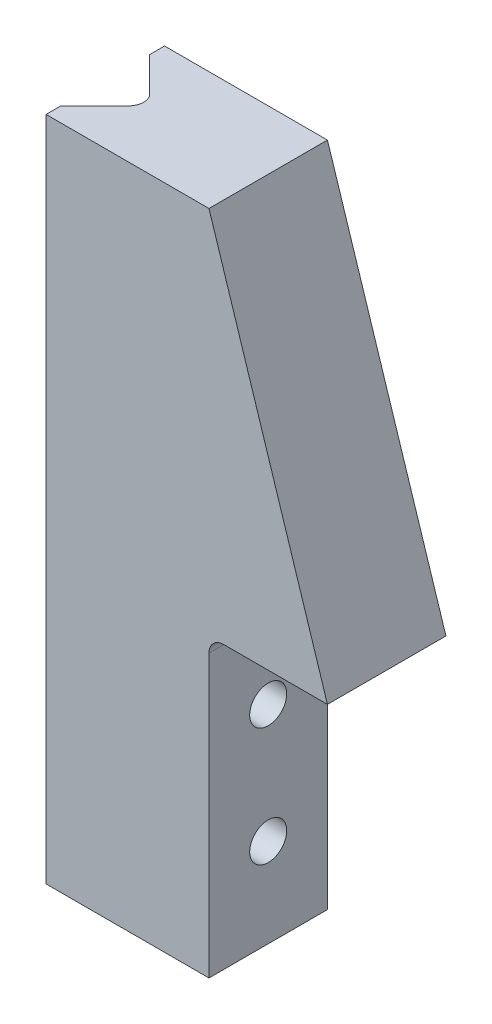
ISO-10303-21;
HEADER;
FILE_DESCRIPTION(('STEP AP214'),'2;1');
FILE_NAME('part.step','',(''),(''),'','','');
FILE_SCHEMA(('AUTOMOTIVE_DESIGN { 1 0 10303 214 1 1 1 1 }'));
ENDSEC;
DATA;
#1=APPLICATION_CONTEXT('core data for automotive mechanical design processes');
#2=APPLICATION_PROTOCOL_DEFINITION('international standard','automotive_design',2000,#1);
#3=PRODUCT_CONTEXT('',#1,'mechanical');
#4=PRODUCT('Part','Part','',(#3));
#5=PRODUCT_RELATED_PRODUCT_CATEGORY('part','',(#4));
#6=PRODUCT_DEFINITION_FORMATION('','',#4);
#7=PRODUCT_DEFINITION_CONTEXT('part definition',#1,'design');
#8=PRODUCT_DEFINITION('design','',#6,#7);
#9=PRODUCT_DEFINITION_SHAPE('','',#8);
#10=(LENGTH_UNIT() NAMED_UNIT(*) SI_UNIT(.MILLI.,.METRE.));
#11=(NAMED_UNIT(*) PLANE_ANGLE_UNIT() SI_UNIT($,.RADIAN.));
#12=(NAMED_UNIT(*) SI_UNIT($,.STERADIAN.) SOLID_ANGLE_UNIT());
#13=UNCERTAINTY_MEASURE_WITH_UNIT(LENGTH_MEASURE(1.E-05),#10,'distance_accuracy_value','');
#14=(GEOMETRIC_REPRESENTATION_CONTEXT(3) GLOBAL_UNCERTAINTY_ASSIGNED_CONTEXT((#13)) GLOBAL_UNIT_ASSIGNED_CONTEXT((#10,
#11,#12)) REPRESENTATION_CONTEXT('',''));
#15=CARTESIAN_POINT('',(0.,0.,0.));
#16=DIRECTION('',(0.,0.,1.));
#17=DIRECTION('',(1.,0.,0.));
#18=AXIS2_PLACEMENT_3D('',#15,#16,#17);
#19=CARTESIAN_POINT('',(-19.,-20.,8.));
#20=DIRECTION('',(1.,0.,0.));
#21=DIRECTION('',(0.,0.,-1.));
#22=AXIS2_PLACEMENT_3D('',#19,#20,#21);
#23=PLANE('',#22);
#24=DIRECTION('',(0.,0.,-1.));
#25=VECTOR('',#24,1.);
#26=CARTESIAN_POINT('',(-19.,-20.,8.));
#27=LINE('',#26,#25);
#28=CARTESIAN_POINT('',(-19.,-20.,1.));
#29=VERTEX_POINT('',#28);
#30=CARTESIAN_POINT('',(-19.,-20.,0.));
#31=VERTEX_POINT('',#30);
#32=EDGE_CURVE('E195',#29,#31,#27,.T.);
#33=ORIENTED_EDGE('',*,*,#32,.F.);
#34=DIRECTION('',(0.,1.,0.));
#35=VECTOR('',#34,1.);
#36=CARTESIAN_POINT('',(-19.,-20.,1.));
#37=LINE('',#36,#35);
#38=CARTESIAN_POINT('',(-19.,25.,1.));
#39=VERTEX_POINT('',#38);
#40=EDGE_CURVE('E157',#29,#39,#37,.T.);
#41=ORIENTED_EDGE('',*,*,#40,.T.);
#42=DIRECTION('',(0.,0.,-1.));
#43=VECTOR('',#42,1.);
#44=CARTESIAN_POINT('',(-19.,25.,8.));
#45=LINE('',#44,#43);
#46=CARTESIAN_POINT('',(-19.,25.,0.));
#47=VERTEX_POINT('',#46);
#48=EDGE_CURVE('E199',#39,#47,#45,.T.);
#49=ORIENTED_EDGE('',*,*,#48,.T.);
#50=DIRECTION('',(0.,-1.,0.));
#51=VECTOR('',#50,1.);
#52=CARTESIAN_POINT('',(-19.,-20.,0.));
#53=LINE('',#52,#51);
#54=EDGE_CURVE('E182',#47,#31,#53,.T.);
#55=ORIENTED_EDGE('',*,*,#54,.T.);
#56=EDGE_LOOP('',(#33,#41,#49,#55));
#57=FACE_BOUND('',#56,.T.);
#58=ADVANCED_FACE('F38',(#57),#23,.F.);
#59=CARTESIAN_POINT('',(-8.,25.,8.));
#60=DIRECTION('',(-0.952424147199324,-0.304775727103784,0.));
#61=DIRECTION('',(0.304775727103784,-0.952424147199324,0.));
#62=AXIS2_PLACEMENT_3D('',#59,#60,#61);
#63=PLANE('',#62);
#64=DIRECTION('',(-0.304775727103784,0.952424147199324,0.));
#65=VECTOR('',#64,1.);
#66=CARTESIAN_POINT('',(-8.,25.,0.));
#67=LINE('',#66,#65);
#68=CARTESIAN_POINT('',(0.,0.,0.));
#69=VERTEX_POINT('',#68);
#70=CARTESIAN_POINT('',(-8.,25.,0.));
#71=VERTEX_POINT('',#70);
#72=EDGE_CURVE('E160',#69,#71,#67,.T.);
#73=ORIENTED_EDGE('',*,*,#72,.T.);
#74=DIRECTION('',(0.,0.,-1.));
#75=VECTOR('',#74,1.);
#76=CARTESIAN_POINT('',(-8.,25.,8.));
#77=LINE('',#76,#75);
#78=CARTESIAN_POINT('',(-8.,25.,8.));
#79=VERTEX_POINT('',#78);
#80=EDGE_CURVE('E203',#79,#71,#77,.T.);
#81=ORIENTED_EDGE('',*,*,#80,.F.);
#82=DIRECTION('',(-0.304775727103784,0.952424147199324,0.));
#83=VECTOR('',#82,1.);
#84=CARTESIAN_POINT('',(-8.,25.,8.));
#85=LINE('',#84,#83);
#86=CARTESIAN_POINT('',(0.,0.,8.));
#87=VERTEX_POINT('',#86);
#88=EDGE_CURVE('E162',#87,#79,#85,.T.);
#89=ORIENTED_EDGE('',*,*,#88,.F.);
#90=DIRECTION('',(0.,0.,-1.));
#91=VECTOR('',#90,1.);
#92=CARTESIAN_POINT('',(0.,0.,8.));
#93=LINE('',#92,#91);
#94=EDGE_CURVE('E176',#87,#69,#93,.T.);
#95=ORIENTED_EDGE('',*,*,#94,.T.);
#96=EDGE_LOOP('',(#73,#81,#89,#95));
#97=FACE_BOUND('',#96,.T.);
#98=ADVANCED_FACE('F230',(#97),#63,.F.);
#99=CARTESIAN_POINT('',(-19.,25.,8.));
#100=DIRECTION('',(0.,-1.,0.));
#101=DIRECTION('',(0.,0.,-1.));
#102=AXIS2_PLACEMENT_3D('',#99,#100,#101);
#103=PLANE('',#102);
#104=ORIENTED_EDGE('',*,*,#48,.F.);
#105=DIRECTION('',(-0.707106781186554,0.,-0.707106781186541));
#106=VECTOR('',#105,1.);
#107=CARTESIAN_POINT('',(-19.,25.,1.));
#108=LINE('',#107,#106);
#109=CARTESIAN_POINT('',(-16.7071067811865,25.,3.29289321881346));
#110=VERTEX_POINT('',#109);
#111=EDGE_CURVE('E151',#110,#39,#108,.T.);
#112=ORIENTED_EDGE('',*,*,#111,.F.);
#113=CARTESIAN_POINT('',(-17.414213562373,25.,4.00000000000001));
#114=DIRECTION('',(0.,-1.,0.));
#115=DIRECTION('',(0.,0.,-1.));
#116=AXIS2_PLACEMENT_3D('',#113,#114,#115);
#117=CIRCLE('',#116,1.);
#118=CARTESIAN_POINT('',(-16.7071067811865,25.,4.70710678118655));
#119=VERTEX_POINT('',#118);
#120=EDGE_CURVE('E211',#110,#119,#117,.T.);
#121=ORIENTED_EDGE('',*,*,#120,.T.);
#122=DIRECTION('',(0.707106781186541,0.,-0.707106781186554));
#123=VECTOR('',#122,1.);
#124=CARTESIAN_POINT('',(-15.9999999999999,25.,4.));
#125=LINE('',#124,#123);
#126=CARTESIAN_POINT('',(-19.,25.,7.0000000000001));
#127=VERTEX_POINT('',#126);
#128=EDGE_CURVE('E146',#127,#119,#125,.T.);
#129=ORIENTED_EDGE('',*,*,#128,.F.);
#130=CARTESIAN_POINT('',(-19.,25.,8.));
#131=VERTEX_POINT('',#130);
#132=EDGE_CURVE('E200',#131,#127,#45,.T.);
#133=ORIENTED_EDGE('',*,*,#132,.F.);
#134=DIRECTION('',(-1.,0.,0.));
#135=VECTOR('',#134,1.);
#136=CARTESIAN_POINT('',(-19.,25.,8.));
#137=LINE('',#136,#135);
#138=EDGE_CURVE('E165',#79,#131,#137,.T.);
#139=ORIENTED_EDGE('',*,*,#138,.F.);
#140=ORIENTED_EDGE('',*,*,#80,.T.);
#141=DIRECTION('',(-1.,0.,0.));
#142=VECTOR('',#141,1.);
#143=CARTESIAN_POINT('',(-19.,25.,0.));
#144=LINE('',#143,#142);
#145=EDGE_CURVE('E179',#71,#47,#144,.T.);
#146=ORIENTED_EDGE('',*,*,#145,.T.);
#147=EDGE_LOOP('',(#104,#112,#121,#129,#133,#139,#140,#146));
#148=FACE_BOUND('',#147,.T.);
#149=ADVANCED_FACE('F248',(#148),#103,.F.);
#150=ORIENTED_EDGE('',*,*,#132,.T.);
#151=DIRECTION('',(0.,1.,0.));
#152=VECTOR('',#151,1.);
#153=CARTESIAN_POINT('',(-19.,-20.,7.0000000000001));
#154=LINE('',#153,#152);
#155=CARTESIAN_POINT('',(-19.,-20.,7.0000000000001));
#156=VERTEX_POINT('',#155);
#157=EDGE_CURVE('E153',#156,#127,#154,.T.);
#158=ORIENTED_EDGE('',*,*,#157,.F.);
#159=CARTESIAN_POINT('',(-19.,-20.,8.));
#160=VERTEX_POINT('',#159);
#161=EDGE_CURVE('E196',#160,#156,#27,.T.);
#162=ORIENTED_EDGE('',*,*,#161,.F.);
#163=DIRECTION('',(0.,-1.,0.));
#164=VECTOR('',#163,1.);
#165=CARTESIAN_POINT('',(-19.,-20.,8.));
#166=LINE('',#165,#164);
#167=EDGE_CURVE('E168',#131,#160,#166,.T.);
#168=ORIENTED_EDGE('',*,*,#167,.F.);
#169=EDGE_LOOP('',(#150,#158,#162,#168));
#170=FACE_BOUND('',#169,.T.);
#171=ADVANCED_FACE('F244',(#170),#23,.F.);
#172=CARTESIAN_POINT('',(-8.,-20.,8.));
#173=DIRECTION('',(0.,1.,0.));
#174=DIRECTION('',(-1.,0.,0.));
#175=AXIS2_PLACEMENT_3D('',#172,#173,#174);
#176=PLANE('',#175);
#177=DIRECTION('',(0.707106781186541,0.,-0.707106781186554));
#178=VECTOR('',#177,1.);
#179=CARTESIAN_POINT('',(-15.9999999999999,-20.,4.));
#180=LINE('',#179,#178);
#181=CARTESIAN_POINT('',(-16.7071067811865,-20.,4.70710678118655));
#182=VERTEX_POINT('',#181);
#183=EDGE_CURVE('E147',#156,#182,#180,.T.);
#184=ORIENTED_EDGE('',*,*,#183,.T.);
#185=CARTESIAN_POINT('',(-17.414213562373,-20.,4.00000000000001));
#186=DIRECTION('',(0.,1.,0.));
#187=DIRECTION('',(-1.,0.,0.));
#188=AXIS2_PLACEMENT_3D('',#185,#186,#187);
#189=CIRCLE('',#188,1.);
#190=CARTESIAN_POINT('',(-16.7071067811865,-20.,3.29289321881346));
#191=VERTEX_POINT('',#190);
#192=EDGE_CURVE('E213',#182,#191,#189,.T.);
#193=ORIENTED_EDGE('',*,*,#192,.T.);
#194=DIRECTION('',(-0.707106781186554,0.,-0.707106781186541));
#195=VECTOR('',#194,1.);
#196=CARTESIAN_POINT('',(-19.,-20.,1.));
#197=LINE('',#196,#195);
#198=EDGE_CURVE('E150',#191,#29,#197,.T.);
#199=ORIENTED_EDGE('',*,*,#198,.T.);
#200=ORIENTED_EDGE('',*,*,#32,.T.);
#201=DIRECTION('',(1.,0.,0.));
#202=VECTOR('',#201,1.);
#203=CARTESIAN_POINT('',(-8.,-20.,0.));
#204=LINE('',#203,#202);
#205=CARTESIAN_POINT('',(-8.,-20.,0.));
#206=VERTEX_POINT('',#205);
#207=EDGE_CURVE('E185',#31,#206,#204,.T.);
#208=ORIENTED_EDGE('',*,*,#207,.T.);
#209=DIRECTION('',(0.,0.,-1.));
#210=VECTOR('',#209,1.);
#211=CARTESIAN_POINT('',(-8.,-20.,8.));
#212=LINE('',#211,#210);
#213=CARTESIAN_POINT('',(-8.,-20.,8.));
#214=VERTEX_POINT('',#213);
#215=EDGE_CURVE('E192',#214,#206,#212,.T.);
#216=ORIENTED_EDGE('',*,*,#215,.F.);
#217=DIRECTION('',(1.,0.,0.));
#218=VECTOR('',#217,1.);
#219=CARTESIAN_POINT('',(-8.,-20.,8.));
#220=LINE('',#219,#218);
#221=EDGE_CURVE('E170',#160,#214,#220,.T.);
#222=ORIENTED_EDGE('',*,*,#221,.F.);
#223=ORIENTED_EDGE('',*,*,#161,.T.);
#224=EDGE_LOOP('',(#184,#193,#199,#200,#208,#216,#222,#223));
#225=FACE_BOUND('',#224,.T.);
#226=ADVANCED_FACE('F254',(#225),#176,.F.);
#227=CARTESIAN_POINT('',(-8.,0.,8.));
#228=DIRECTION('',(-1.,0.,0.));
#229=DIRECTION('',(0.,0.,1.));
#230=AXIS2_PLACEMENT_3D('',#227,#228,#229);
#231=PLANE('',#230);
#232=CARTESIAN_POINT('',(-8.,-6.,4.));
#233=DIRECTION('',(1.,0.,0.));
#234=DIRECTION('',(0.,0.,-1.));
#235=AXIS2_PLACEMENT_3D('',#232,#233,#234);
#236=CIRCLE('',#235,1.25);
#237=CARTESIAN_POINT('',(-8.,-6.,2.75));
#238=VERTEX_POINT('',#237);
#239=EDGE_CURVE('E136',#238,#238,#236,.T.);
#240=ORIENTED_EDGE('',*,*,#239,.F.);
#241=EDGE_LOOP('',(#240));
#242=FACE_BOUND('',#241,.T.);
#243=CARTESIAN_POINT('',(-8.,-14.,4.));
#244=DIRECTION('',(1.,0.,0.));
#245=DIRECTION('',(0.,0.,-1.));
#246=AXIS2_PLACEMENT_3D('',#243,#244,#245);
#247=CIRCLE('',#246,1.25);
#248=CARTESIAN_POINT('',(-8.,-14.,2.75));
#249=VERTEX_POINT('',#248);
#250=EDGE_CURVE('E135',#249,#249,#247,.T.);
#251=ORIENTED_EDGE('',*,*,#250,.F.);
#252=EDGE_LOOP('',(#251));
#253=FACE_BOUND('',#252,.T.);
#254=DIRECTION('',(0.,1.,0.));
#255=VECTOR('',#254,1.);
#256=CARTESIAN_POINT('',(-8.,0.,0.));
#257=LINE('',#256,#255);
#258=CARTESIAN_POINT('',(-8.,-1.,0.));
#259=VERTEX_POINT('',#258);
#260=EDGE_CURVE('E187',#206,#259,#257,.T.);
#261=ORIENTED_EDGE('',*,*,#260,.T.);
#262=DIRECTION('',(0.,0.,-1.));
#263=VECTOR('',#262,1.);
#264=CARTESIAN_POINT('',(-8.,-1.,8.));
#265=LINE('',#264,#263);
#266=CARTESIAN_POINT('',(-8.,-1.,8.));
#267=VERTEX_POINT('',#266);
#268=EDGE_CURVE('E53',#259,#267,#265,.F.);
#269=ORIENTED_EDGE('',*,*,#268,.T.);
#270=DIRECTION('',(0.,1.,0.));
#271=VECTOR('',#270,1.);
#272=CARTESIAN_POINT('',(-8.,0.,8.));
#273=LINE('',#272,#271);
#274=EDGE_CURVE('E172',#214,#267,#273,.T.);
#275=ORIENTED_EDGE('',*,*,#274,.F.);
#276=ORIENTED_EDGE('',*,*,#215,.T.);
#277=EDGE_LOOP('',(#261,#269,#275,#276));
#278=FACE_BOUND('',#277,.T.);
#279=ADVANCED_FACE('F261',(#242,#253,#278),#231,.F.);
#280=CARTESIAN_POINT('',(0.,0.,8.));
#281=DIRECTION('',(0.,1.,0.));
#282=DIRECTION('',(0.,0.,1.));
#283=AXIS2_PLACEMENT_3D('',#280,#281,#282);
#284=PLANE('',#283);
#285=DIRECTION('',(1.,0.,0.));
#286=VECTOR('',#285,1.);
#287=CARTESIAN_POINT('',(0.,0.,8.));
#288=LINE('',#287,#286);
#289=CARTESIAN_POINT('',(-7.,0.,8.));
#290=VERTEX_POINT('',#289);
#291=EDGE_CURVE('E174',#290,#87,#288,.T.);
#292=ORIENTED_EDGE('',*,*,#291,.F.);
#293=DIRECTION('',(0.,0.,-1.));
#294=VECTOR('',#293,1.);
#295=CARTESIAN_POINT('',(-7.,0.,0.));
#296=LINE('',#295,#294);
#297=CARTESIAN_POINT('',(-7.,0.,0.));
#298=VERTEX_POINT('',#297);
#299=EDGE_CURVE('E215',#290,#298,#296,.T.);
#300=ORIENTED_EDGE('',*,*,#299,.T.);
#301=DIRECTION('',(1.,0.,0.));
#302=VECTOR('',#301,1.);
#303=CARTESIAN_POINT('',(0.,0.,0.));
#304=LINE('',#303,#302);
#305=EDGE_CURVE('E166',#298,#69,#304,.T.);
#306=ORIENTED_EDGE('',*,*,#305,.T.);
#307=ORIENTED_EDGE('',*,*,#94,.F.);
#308=EDGE_LOOP('',(#292,#300,#306,#307));
#309=FACE_BOUND('',#308,.T.);
#310=ADVANCED_FACE('F221',(#309),#284,.F.);
#311=CARTESIAN_POINT('',(0.,0.,8.));
#312=DIRECTION('',(0.,0.,-1.));
#313=DIRECTION('',(-1.,0.,0.));
#314=AXIS2_PLACEMENT_3D('',#311,#312,#313);
#315=PLANE('',#314);
#316=ORIENTED_EDGE('',*,*,#88,.T.);
#317=ORIENTED_EDGE('',*,*,#138,.T.);
#318=ORIENTED_EDGE('',*,*,#167,.T.);
#319=ORIENTED_EDGE('',*,*,#221,.T.);
#320=ORIENTED_EDGE('',*,*,#274,.T.);
#321=CARTESIAN_POINT('',(-7.,-1.,8.));
#322=DIRECTION('',(0.,0.,-1.));
#323=DIRECTION('',(-1.,0.,0.));
#324=AXIS2_PLACEMENT_3D('',#321,#322,#323);
#325=CIRCLE('',#324,1.);
#326=EDGE_CURVE('E11',#267,#290,#325,.T.);
#327=ORIENTED_EDGE('',*,*,#326,.T.);
#328=ORIENTED_EDGE('',*,*,#291,.T.);
#329=EDGE_LOOP('',(#316,#317,#318,#319,#320,#327,#328));
#330=FACE_BOUND('',#329,.T.);
#331=ADVANCED_FACE('F233',(#330),#315,.F.);
#332=CARTESIAN_POINT('',(0.,0.,0.));
#333=DIRECTION('',(0.,0.,-1.));
#334=DIRECTION('',(-1.,0.,0.));
#335=AXIS2_PLACEMENT_3D('',#332,#333,#334);
#336=PLANE('',#335);
#337=ORIENTED_EDGE('',*,*,#72,.F.);
#338=ORIENTED_EDGE('',*,*,#305,.F.);
#339=CARTESIAN_POINT('',(-7.,-1.,0.));
#340=DIRECTION('',(0.,0.,-1.));
#341=DIRECTION('',(-1.,0.,0.));
#342=AXIS2_PLACEMENT_3D('',#339,#340,#341);
#343=CIRCLE('',#342,1.);
#344=EDGE_CURVE('E46',#298,#259,#343,.F.);
#345=ORIENTED_EDGE('',*,*,#344,.T.);
#346=ORIENTED_EDGE('',*,*,#260,.F.);
#347=ORIENTED_EDGE('',*,*,#207,.F.);
#348=ORIENTED_EDGE('',*,*,#54,.F.);
#349=ORIENTED_EDGE('',*,*,#145,.F.);
#350=EDGE_LOOP('',(#337,#338,#345,#346,#347,#348,#349));
#351=FACE_BOUND('',#350,.T.);
#352=ADVANCED_FACE('F226',(#351),#336,.T.);
#353=CARTESIAN_POINT('',(-19.,-20.,1.));
#354=DIRECTION('',(0.707106781186541,0.,-0.707106781186553));
#355=DIRECTION('',(-0.707106781186554,0.,-0.707106781186542));
#356=AXIS2_PLACEMENT_3D('',#353,#354,#355);
#357=PLANE('',#356);
#358=ORIENTED_EDGE('',*,*,#198,.F.);
#359=DIRECTION('',(0.,1.,0.));
#360=VECTOR('',#359,1.);
#361=CARTESIAN_POINT('',(-16.7071067811865,25.,3.29289321881346));
#362=LINE('',#361,#360);
#363=EDGE_CURVE('E206',#191,#110,#362,.T.);
#364=ORIENTED_EDGE('',*,*,#363,.T.);
#365=ORIENTED_EDGE('',*,*,#111,.T.);
#366=ORIENTED_EDGE('',*,*,#40,.F.);
#367=EDGE_LOOP('',(#358,#364,#365,#366));
#368=FACE_BOUND('',#367,.T.);
#369=ADVANCED_FACE('F279',(#368),#357,.F.);
#370=CARTESIAN_POINT('',(-15.9999999999999,-20.,4.));
#371=DIRECTION('',(0.707106781186554,0.,0.707106781186541));
#372=DIRECTION('',(0.707106781186541,0.,-0.707106781186554));
#373=AXIS2_PLACEMENT_3D('',#370,#371,#372);
#374=PLANE('',#373);
#375=ORIENTED_EDGE('',*,*,#128,.T.);
#376=DIRECTION('',(0.,1.,0.));
#377=VECTOR('',#376,1.);
#378=CARTESIAN_POINT('',(-16.7071067811865,-20.,4.70710678118655));
#379=LINE('',#378,#377);
#380=EDGE_CURVE('E209',#119,#182,#379,.F.);
#381=ORIENTED_EDGE('',*,*,#380,.T.);
#382=ORIENTED_EDGE('',*,*,#183,.F.);
#383=ORIENTED_EDGE('',*,*,#157,.T.);
#384=EDGE_LOOP('',(#375,#381,#382,#383));
#385=FACE_BOUND('',#384,.T.);
#386=ADVANCED_FACE('F273',(#385),#374,.F.);
#387=CARTESIAN_POINT('',(-13.,-14.,4.));
#388=DIRECTION('',(1.,0.,0.));
#389=DIRECTION('',(0.,0.,-1.));
#390=AXIS2_PLACEMENT_3D('',#387,#388,#389);
#391=CONICAL_SURFACE('',#390,1.25,1.02974425867665);
#392=CARTESIAN_POINT('',(-13.7510757737845,-14.,4.));
#393=VERTEX_POINT('',#392);
#394=VERTEX_LOOP('',#393);
#395=FACE_BOUND('',#394,.T.);
#396=CARTESIAN_POINT('',(-13.,-14.,4.));
#397=DIRECTION('',(1.,0.,0.));
#398=DIRECTION('',(0.,0.,-1.));
#399=AXIS2_PLACEMENT_3D('',#396,#397,#398);
#400=CIRCLE('',#399,1.25);
#401=CARTESIAN_POINT('',(-13.,-14.,2.75));
#402=VERTEX_POINT('',#401);
#403=EDGE_CURVE('E139',#402,#402,#400,.T.);
#404=ORIENTED_EDGE('',*,*,#403,.T.);
#405=EDGE_LOOP('',(#404));
#406=FACE_BOUND('',#405,.T.);
#407=ADVANCED_FACE('F300',(#395,#406),#391,.F.);
#408=CARTESIAN_POINT('',(-8.,-14.,4.));
#409=DIRECTION('',(1.,0.,0.));
#410=DIRECTION('',(0.,0.,-1.));
#411=AXIS2_PLACEMENT_3D('',#408,#409,#410);
#412=CYLINDRICAL_SURFACE('',#411,1.25);
#413=ORIENTED_EDGE('',*,*,#403,.F.);
#414=EDGE_LOOP('',(#413));
#415=FACE_BOUND('',#414,.T.);
#416=ORIENTED_EDGE('',*,*,#250,.T.);
#417=EDGE_LOOP('',(#416));
#418=FACE_BOUND('',#417,.T.);
#419=ADVANCED_FACE('F129',(#415,#418),#412,.F.);
#420=CARTESIAN_POINT('',(-13.,-6.,4.));
#421=DIRECTION('',(1.,0.,0.));
#422=DIRECTION('',(0.,0.,-1.));
#423=AXIS2_PLACEMENT_3D('',#420,#421,#422);
#424=CONICAL_SURFACE('',#423,1.25,1.02974425867665);
#425=CARTESIAN_POINT('',(-13.7510757737845,-6.,4.));
#426=VERTEX_POINT('',#425);
#427=VERTEX_LOOP('',#426);
#428=FACE_BOUND('',#427,.T.);
#429=CARTESIAN_POINT('',(-13.,-6.,4.));
#430=DIRECTION('',(1.,0.,0.));
#431=DIRECTION('',(0.,0.,-1.));
#432=AXIS2_PLACEMENT_3D('',#429,#430,#431);
#433=CIRCLE('',#432,1.25);
#434=CARTESIAN_POINT('',(-13.,-6.,2.75));
#435=VERTEX_POINT('',#434);
#436=EDGE_CURVE('E133',#435,#435,#433,.T.);
#437=ORIENTED_EDGE('',*,*,#436,.T.);
#438=EDGE_LOOP('',(#437));
#439=FACE_BOUND('',#438,.T.);
#440=ADVANCED_FACE('F125',(#428,#439),#424,.F.);
#441=CARTESIAN_POINT('',(-8.,-6.,4.));
#442=DIRECTION('',(1.,0.,0.));
#443=DIRECTION('',(0.,0.,-1.));
#444=AXIS2_PLACEMENT_3D('',#441,#442,#443);
#445=CYLINDRICAL_SURFACE('',#444,1.25);
#446=ORIENTED_EDGE('',*,*,#436,.F.);
#447=EDGE_LOOP('',(#446));
#448=FACE_BOUND('',#447,.T.);
#449=ORIENTED_EDGE('',*,*,#239,.T.);
#450=EDGE_LOOP('',(#449));
#451=FACE_BOUND('',#450,.T.);
#452=ADVANCED_FACE('F128',(#448,#451),#445,.F.);
#453=CARTESIAN_POINT('',(-17.414213562373,-20.,4.00000000000001));
#454=DIRECTION('',(0.,-1.,0.));
#455=DIRECTION('',(0.,0.,-1.));
#456=AXIS2_PLACEMENT_3D('',#453,#454,#455);
#457=CYLINDRICAL_SURFACE('',#456,1.);
#458=ORIENTED_EDGE('',*,*,#192,.F.);
#459=ORIENTED_EDGE('',*,*,#380,.F.);
#460=ORIENTED_EDGE('',*,*,#120,.F.);
#461=ORIENTED_EDGE('',*,*,#363,.F.);
#462=EDGE_LOOP('',(#458,#459,#460,#461));
#463=FACE_BOUND('',#462,.T.);
#464=ADVANCED_FACE('F236',(#463),#457,.F.);
#465=CARTESIAN_POINT('',(-7.,-1.,8.));
#466=DIRECTION('',(0.,0.,1.));
#467=DIRECTION('',(1.,0.,0.));
#468=AXIS2_PLACEMENT_3D('',#465,#466,#467);
#469=CYLINDRICAL_SURFACE('',#468,1.);
#470=ORIENTED_EDGE('',*,*,#326,.F.);
#471=ORIENTED_EDGE('',*,*,#268,.F.);
#472=ORIENTED_EDGE('',*,*,#344,.F.);
#473=ORIENTED_EDGE('',*,*,#299,.F.);
#474=EDGE_LOOP('',(#470,#471,#472,#473));
#475=FACE_BOUND('',#474,.T.);
#476=ADVANCED_FACE('F40',(#475),#469,.F.);
#477=CLOSED_SHELL('',(#58,#98,#149,#171,#226,#279,#310,#331,#352,#369,#386,#407,#419,#440,#452,
#464,#476));
#478=MANIFOLD_SOLID_BREP('B2',#477);
#479=ADVANCED_BREP_SHAPE_REPRESENTATION('',(#18,#478),#14);
#480=SHAPE_DEFINITION_REPRESENTATION(#9,#479);
ENDSEC;
END-ISO-10303-21;
